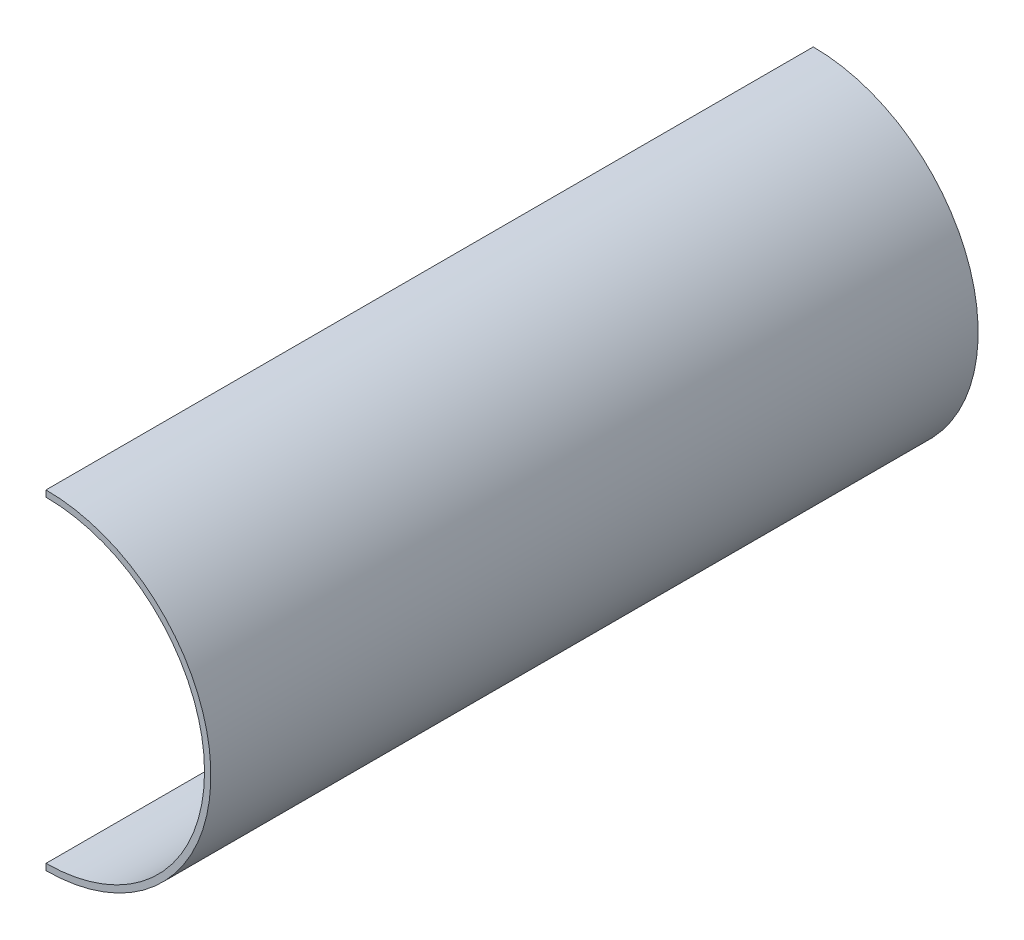
ISO-10303-21;
HEADER;
FILE_DESCRIPTION(('STEP AP214'),'2;1');
FILE_NAME('part.step','',(''),(''),'','','');
FILE_SCHEMA(('AUTOMOTIVE_DESIGN { 1 0 10303 214 1 1 1 1 }'));
ENDSEC;
DATA;
#1=APPLICATION_CONTEXT('core data for automotive mechanical design processes');
#2=APPLICATION_PROTOCOL_DEFINITION('international standard','automotive_design',2000,#1);
#3=PRODUCT_CONTEXT('',#1,'mechanical');
#4=PRODUCT('Part','Part','',(#3));
#5=PRODUCT_RELATED_PRODUCT_CATEGORY('part','',(#4));
#6=PRODUCT_DEFINITION_FORMATION('','',#4);
#7=PRODUCT_DEFINITION_CONTEXT('part definition',#1,'design');
#8=PRODUCT_DEFINITION('design','',#6,#7);
#9=PRODUCT_DEFINITION_SHAPE('','',#8);
#10=(LENGTH_UNIT() NAMED_UNIT(*) SI_UNIT(.MILLI.,.METRE.));
#11=(NAMED_UNIT(*) PLANE_ANGLE_UNIT() SI_UNIT($,.RADIAN.));
#12=(NAMED_UNIT(*) SI_UNIT($,.STERADIAN.) SOLID_ANGLE_UNIT());
#13=UNCERTAINTY_MEASURE_WITH_UNIT(LENGTH_MEASURE(1.E-05),#10,'distance_accuracy_value','');
#14=(GEOMETRIC_REPRESENTATION_CONTEXT(3) GLOBAL_UNCERTAINTY_ASSIGNED_CONTEXT((#13)) GLOBAL_UNIT_ASSIGNED_CONTEXT((#10,
#11,#12)) REPRESENTATION_CONTEXT('',''));
#15=CARTESIAN_POINT('',(0.,0.,0.));
#16=DIRECTION('',(0.,0.,1.));
#17=DIRECTION('',(1.,0.,0.));
#18=AXIS2_PLACEMENT_3D('',#15,#16,#17);
#19=CARTESIAN_POINT('',(50.,0.,242.));
#20=DIRECTION('',(0.,0.,-1.));
#21=DIRECTION('',(-1.,0.,0.));
#22=AXIS2_PLACEMENT_3D('',#19,#20,#21);
#23=CYLINDRICAL_SURFACE('',#22,50.);
#24=CARTESIAN_POINT('',(50.,0.,3.));
#25=DIRECTION('',(0.,0.,-1.));
#26=DIRECTION('',(-1.,0.,0.));
#27=AXIS2_PLACEMENT_3D('',#24,#25,#26);
#28=CIRCLE('',#27,49.9999999999998);
#29=CARTESIAN_POINT('',(50.,49.9999999999997,3.));
#30=VERTEX_POINT('',#29);
#31=CARTESIAN_POINT('',(50.,-49.9999999999999,3.));
#32=VERTEX_POINT('',#31);
#33=EDGE_CURVE('E117',#30,#32,#28,.T.);
#34=ORIENTED_EDGE('',*,*,#33,.T.);
#35=DIRECTION('',(0.,0.,-1.));
#36=VECTOR('',#35,1.);
#37=CARTESIAN_POINT('',(50.,-50.,242.));
#38=LINE('',#37,#36);
#39=CARTESIAN_POINT('',(50.,-50.,242.));
#40=VERTEX_POINT('',#39);
#41=EDGE_CURVE('E11',#40,#32,#38,.T.);
#42=ORIENTED_EDGE('',*,*,#41,.F.);
#43=CARTESIAN_POINT('',(50.,0.,242.));
#44=DIRECTION('',(0.,0.,-1.));
#45=DIRECTION('',(-1.,0.,0.));
#46=AXIS2_PLACEMENT_3D('',#43,#44,#45);
#47=CIRCLE('',#46,50.);
#48=CARTESIAN_POINT('',(50.,49.9999999999997,242.));
#49=VERTEX_POINT('',#48);
#50=EDGE_CURVE('E60',#49,#40,#47,.T.);
#51=ORIENTED_EDGE('',*,*,#50,.F.);
#52=DIRECTION('',(0.,0.,-1.));
#53=VECTOR('',#52,1.);
#54=CARTESIAN_POINT('',(50.,49.9999999999997,242.));
#55=LINE('',#54,#53);
#56=EDGE_CURVE('E123',#49,#30,#55,.T.);
#57=ORIENTED_EDGE('',*,*,#56,.T.);
#58=EDGE_LOOP('',(#34,#42,#51,#57));
#59=FACE_BOUND('',#58,.T.);
#60=ADVANCED_FACE('F36',(#59),#23,.F.);
#61=CARTESIAN_POINT('',(50.,-50.,242.));
#62=DIRECTION('',(1.,0.,0.));
#63=DIRECTION('',(0.,0.,-1.));
#64=AXIS2_PLACEMENT_3D('',#61,#62,#63);
#65=PLANE('',#64);
#66=DIRECTION('',(0.,-1.,0.));
#67=VECTOR('',#66,1.);
#68=CARTESIAN_POINT('',(50.,-50.,0.));
#69=LINE('',#68,#67);
#70=CARTESIAN_POINT('',(50.,-50.,0.));
#71=VERTEX_POINT('',#70);
#72=CARTESIAN_POINT('',(50.,-51.9999999999999,0.));
#73=VERTEX_POINT('',#72);
#74=EDGE_CURVE('E127',#71,#73,#69,.T.);
#75=ORIENTED_EDGE('',*,*,#74,.T.);
#76=DIRECTION('',(0.,0.,-1.));
#77=VECTOR('',#76,1.);
#78=CARTESIAN_POINT('',(50.,-51.9999999999999,242.));
#79=LINE('',#78,#77);
#80=CARTESIAN_POINT('',(50.,-51.9999999999999,242.));
#81=VERTEX_POINT('',#80);
#82=EDGE_CURVE('E156',#81,#73,#79,.T.);
#83=ORIENTED_EDGE('',*,*,#82,.F.);
#84=DIRECTION('',(0.,-1.,0.));
#85=VECTOR('',#84,1.);
#86=CARTESIAN_POINT('',(50.,-50.,242.));
#87=LINE('',#86,#85);
#88=EDGE_CURVE('E89',#40,#81,#87,.T.);
#89=ORIENTED_EDGE('',*,*,#88,.F.);
#90=ORIENTED_EDGE('',*,*,#41,.T.);
#91=DIRECTION('',(0.,1.,0.));
#92=VECTOR('',#91,1.);
#93=CARTESIAN_POINT('',(50.,-48.,3.));
#94=LINE('',#93,#92);
#95=CARTESIAN_POINT('',(50.,-48.,3.));
#96=VERTEX_POINT('',#95);
#97=EDGE_CURVE('E113',#32,#96,#94,.T.);
#98=ORIENTED_EDGE('',*,*,#97,.T.);
#99=DIRECTION('',(0.,0.,-1.));
#100=VECTOR('',#99,1.);
#101=CARTESIAN_POINT('',(50.,-48.,3.));
#102=LINE('',#101,#100);
#103=CARTESIAN_POINT('',(50.,-48.,2.));
#104=VERTEX_POINT('',#103);
#105=EDGE_CURVE('E177',#96,#104,#102,.T.);
#106=ORIENTED_EDGE('',*,*,#105,.T.);
#107=DIRECTION('',(0.,1.,0.));
#108=VECTOR('',#107,1.);
#109=CARTESIAN_POINT('',(50.,-48.,2.));
#110=LINE('',#109,#108);
#111=CARTESIAN_POINT('',(50.,-49.9999999999999,2.));
#112=VERTEX_POINT('',#111);
#113=EDGE_CURVE('E184',#112,#104,#110,.T.);
#114=ORIENTED_EDGE('',*,*,#113,.F.);
#115=EDGE_CURVE('E44',#112,#71,#38,.T.);
#116=ORIENTED_EDGE('',*,*,#115,.T.);
#117=EDGE_LOOP('',(#75,#83,#89,#90,#98,#106,#114,#116));
#118=FACE_BOUND('',#117,.T.);
#119=ADVANCED_FACE('F38',(#118),#65,.F.);
#120=CARTESIAN_POINT('',(50.,0.,242.));
#121=DIRECTION('',(0.,0.,-1.));
#122=DIRECTION('',(-1.,0.,0.));
#123=AXIS2_PLACEMENT_3D('',#120,#121,#122);
#124=CYLINDRICAL_SURFACE('',#123,52.);
#125=CARTESIAN_POINT('',(50.,0.,0.));
#126=DIRECTION('',(0.,0.,1.));
#127=DIRECTION('',(1.,0.,0.));
#128=AXIS2_PLACEMENT_3D('',#125,#126,#127);
#129=CIRCLE('',#128,52.);
#130=CARTESIAN_POINT('',(50.,52.,0.));
#131=VERTEX_POINT('',#130);
#132=EDGE_CURVE('E167',#73,#131,#129,.T.);
#133=ORIENTED_EDGE('',*,*,#132,.T.);
#134=DIRECTION('',(0.,0.,-1.));
#135=VECTOR('',#134,1.);
#136=CARTESIAN_POINT('',(50.,52.,242.));
#137=LINE('',#136,#135);
#138=CARTESIAN_POINT('',(50.,52.,242.));
#139=VERTEX_POINT('',#138);
#140=EDGE_CURVE('E157',#139,#131,#137,.T.);
#141=ORIENTED_EDGE('',*,*,#140,.F.);
#142=CARTESIAN_POINT('',(50.,0.,242.));
#143=DIRECTION('',(0.,0.,1.));
#144=DIRECTION('',(1.,0.,0.));
#145=AXIS2_PLACEMENT_3D('',#142,#143,#144);
#146=CIRCLE('',#145,51.9999999999999);
#147=EDGE_CURVE('E173',#81,#139,#146,.T.);
#148=ORIENTED_EDGE('',*,*,#147,.F.);
#149=ORIENTED_EDGE('',*,*,#82,.T.);
#150=EDGE_LOOP('',(#133,#141,#148,#149));
#151=FACE_BOUND('',#150,.T.);
#152=ADVANCED_FACE('F130',(#151),#124,.T.);
#153=CARTESIAN_POINT('',(50.,52.,242.));
#154=DIRECTION('',(1.,0.,0.));
#155=DIRECTION('',(0.,0.,-1.));
#156=AXIS2_PLACEMENT_3D('',#153,#154,#155);
#157=PLANE('',#156);
#158=DIRECTION('',(0.,-1.,0.));
#159=VECTOR('',#158,1.);
#160=CARTESIAN_POINT('',(50.,52.,0.));
#161=LINE('',#160,#159);
#162=CARTESIAN_POINT('',(50.,49.9999999999997,0.));
#163=VERTEX_POINT('',#162);
#164=EDGE_CURVE('E164',#131,#163,#161,.T.);
#165=ORIENTED_EDGE('',*,*,#164,.T.);
#166=CARTESIAN_POINT('',(50.,49.9999999999997,2.));
#167=VERTEX_POINT('',#166);
#168=EDGE_CURVE('E82',#167,#163,#55,.T.);
#169=ORIENTED_EDGE('',*,*,#168,.F.);
#170=DIRECTION('',(0.,1.,0.));
#171=VECTOR('',#170,1.);
#172=CARTESIAN_POINT('',(50.,49.9999999999997,2.));
#173=LINE('',#172,#171);
#174=CARTESIAN_POINT('',(50.,48.,2.));
#175=VERTEX_POINT('',#174);
#176=EDGE_CURVE('E51',#175,#167,#173,.T.);
#177=ORIENTED_EDGE('',*,*,#176,.F.);
#178=DIRECTION('',(0.,0.,-1.));
#179=VECTOR('',#178,1.);
#180=CARTESIAN_POINT('',(50.,48.,3.));
#181=LINE('',#180,#179);
#182=CARTESIAN_POINT('',(50.,48.,3.));
#183=VERTEX_POINT('',#182);
#184=EDGE_CURVE('E170',#183,#175,#181,.T.);
#185=ORIENTED_EDGE('',*,*,#184,.F.);
#186=DIRECTION('',(0.,1.,0.));
#187=VECTOR('',#186,1.);
#188=CARTESIAN_POINT('',(50.,49.9999999999997,3.));
#189=LINE('',#188,#187);
#190=EDGE_CURVE('E179',#183,#30,#189,.T.);
#191=ORIENTED_EDGE('',*,*,#190,.T.);
#192=ORIENTED_EDGE('',*,*,#56,.F.);
#193=DIRECTION('',(0.,-1.,0.));
#194=VECTOR('',#193,1.);
#195=CARTESIAN_POINT('',(50.,52.,242.));
#196=LINE('',#195,#194);
#197=EDGE_CURVE('E171',#139,#49,#196,.T.);
#198=ORIENTED_EDGE('',*,*,#197,.F.);
#199=ORIENTED_EDGE('',*,*,#140,.T.);
#200=EDGE_LOOP('',(#165,#169,#177,#185,#191,#192,#198,#199));
#201=FACE_BOUND('',#200,.T.);
#202=ADVANCED_FACE('F135',(#201),#157,.F.);
#203=ORIENTED_EDGE('',*,*,#115,.F.);
#204=CARTESIAN_POINT('',(50.,0.,2.));
#205=DIRECTION('',(0.,0.,-1.));
#206=DIRECTION('',(-1.,0.,0.));
#207=AXIS2_PLACEMENT_3D('',#204,#205,#206);
#208=CIRCLE('',#207,49.9999999999998);
#209=EDGE_CURVE('E154',#167,#112,#208,.T.);
#210=ORIENTED_EDGE('',*,*,#209,.F.);
#211=ORIENTED_EDGE('',*,*,#168,.T.);
#212=CARTESIAN_POINT('',(50.,0.,0.));
#213=DIRECTION('',(0.,0.,-1.));
#214=DIRECTION('',(-1.,0.,0.));
#215=AXIS2_PLACEMENT_3D('',#212,#213,#214);
#216=CIRCLE('',#215,50.);
#217=EDGE_CURVE('E155',#163,#71,#216,.T.);
#218=ORIENTED_EDGE('',*,*,#217,.T.);
#219=EDGE_LOOP('',(#203,#210,#211,#218));
#220=FACE_BOUND('',#219,.T.);
#221=ADVANCED_FACE('F138',(#220),#23,.F.);
#222=CARTESIAN_POINT('',(50.,0.,242.));
#223=DIRECTION('',(0.,0.,-1.));
#224=DIRECTION('',(-1.,0.,0.));
#225=AXIS2_PLACEMENT_3D('',#222,#223,#224);
#226=PLANE('',#225);
#227=ORIENTED_EDGE('',*,*,#50,.T.);
#228=ORIENTED_EDGE('',*,*,#88,.T.);
#229=ORIENTED_EDGE('',*,*,#147,.T.);
#230=ORIENTED_EDGE('',*,*,#197,.T.);
#231=EDGE_LOOP('',(#227,#228,#229,#230));
#232=FACE_BOUND('',#231,.T.);
#233=ADVANCED_FACE('F144',(#232),#226,.F.);
#234=CARTESIAN_POINT('',(50.,0.,0.));
#235=DIRECTION('',(0.,0.,-1.));
#236=DIRECTION('',(-1.,0.,0.));
#237=AXIS2_PLACEMENT_3D('',#234,#235,#236);
#238=PLANE('',#237);
#239=ORIENTED_EDGE('',*,*,#74,.F.);
#240=ORIENTED_EDGE('',*,*,#217,.F.);
#241=ORIENTED_EDGE('',*,*,#164,.F.);
#242=ORIENTED_EDGE('',*,*,#132,.F.);
#243=EDGE_LOOP('',(#239,#240,#241,#242));
#244=FACE_BOUND('',#243,.T.);
#245=ADVANCED_FACE('F149',(#244),#238,.T.);
#246=CARTESIAN_POINT('',(50.,0.,3.));
#247=DIRECTION('',(0.,0.,-1.));
#248=DIRECTION('',(-1.,0.,0.));
#249=AXIS2_PLACEMENT_3D('',#246,#247,#248);
#250=CYLINDRICAL_SURFACE('',#249,48.);
#251=CARTESIAN_POINT('',(50.,0.,2.));
#252=DIRECTION('',(0.,0.,1.));
#253=DIRECTION('',(1.,0.,0.));
#254=AXIS2_PLACEMENT_3D('',#251,#252,#253);
#255=CIRCLE('',#254,48.);
#256=EDGE_CURVE('E182',#104,#175,#255,.T.);
#257=ORIENTED_EDGE('',*,*,#256,.F.);
#258=ORIENTED_EDGE('',*,*,#105,.F.);
#259=CARTESIAN_POINT('',(50.,0.,3.));
#260=DIRECTION('',(0.,0.,1.));
#261=DIRECTION('',(1.,0.,0.));
#262=AXIS2_PLACEMENT_3D('',#259,#260,#261);
#263=CIRCLE('',#262,48.);
#264=EDGE_CURVE('E120',#96,#183,#263,.T.);
#265=ORIENTED_EDGE('',*,*,#264,.T.);
#266=ORIENTED_EDGE('',*,*,#184,.T.);
#267=EDGE_LOOP('',(#257,#258,#265,#266));
#268=FACE_BOUND('',#267,.T.);
#269=ADVANCED_FACE('F191',(#268),#250,.F.);
#270=CARTESIAN_POINT('',(50.,0.,3.));
#271=DIRECTION('',(0.,0.,-1.));
#272=DIRECTION('',(-1.,0.,0.));
#273=AXIS2_PLACEMENT_3D('',#270,#271,#272);
#274=PLANE('',#273);
#275=ORIENTED_EDGE('',*,*,#33,.F.);
#276=ORIENTED_EDGE('',*,*,#190,.F.);
#277=ORIENTED_EDGE('',*,*,#264,.F.);
#278=ORIENTED_EDGE('',*,*,#97,.F.);
#279=EDGE_LOOP('',(#275,#276,#277,#278));
#280=FACE_BOUND('',#279,.T.);
#281=ADVANCED_FACE('F115',(#280),#274,.F.);
#282=CARTESIAN_POINT('',(50.,0.,2.));
#283=DIRECTION('',(0.,0.,-1.));
#284=DIRECTION('',(-1.,0.,0.));
#285=AXIS2_PLACEMENT_3D('',#282,#283,#284);
#286=PLANE('',#285);
#287=ORIENTED_EDGE('',*,*,#209,.T.);
#288=ORIENTED_EDGE('',*,*,#113,.T.);
#289=ORIENTED_EDGE('',*,*,#256,.T.);
#290=ORIENTED_EDGE('',*,*,#176,.T.);
#291=EDGE_LOOP('',(#287,#288,#289,#290));
#292=FACE_BOUND('',#291,.T.);
#293=ADVANCED_FACE('F202',(#292),#286,.T.);
#294=CLOSED_SHELL('',(#60,#119,#152,#202,#221,#233,#245,#269,#281,#293));
#295=MANIFOLD_SOLID_BREP('B2',#294);
#296=ADVANCED_BREP_SHAPE_REPRESENTATION('',(#18,#295),#14);
#297=SHAPE_DEFINITION_REPRESENTATION(#9,#296);
ENDSEC;
END-ISO-10303-21;
